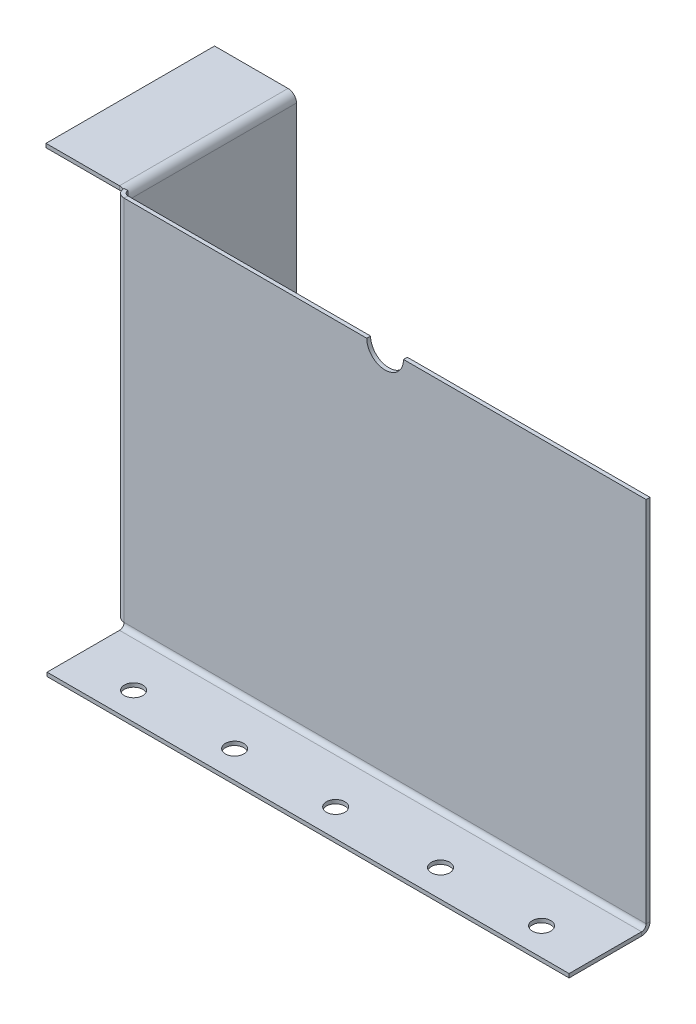
ISO-10303-21;
HEADER;
FILE_DESCRIPTION(('STEP AP214'),'2;1');
FILE_NAME('part.step','',(''),(''),'','','');
FILE_SCHEMA(('AUTOMOTIVE_DESIGN { 1 0 10303 214 1 1 1 1 }'));
ENDSEC;
DATA;
#1=APPLICATION_CONTEXT('core data for automotive mechanical design processes');
#2=APPLICATION_PROTOCOL_DEFINITION('international standard','automotive_design',2000,#1);
#3=PRODUCT_CONTEXT('',#1,'mechanical');
#4=PRODUCT('Part','Part','',(#3));
#5=PRODUCT_RELATED_PRODUCT_CATEGORY('part','',(#4));
#6=PRODUCT_DEFINITION_FORMATION('','',#4);
#7=PRODUCT_DEFINITION_CONTEXT('part definition',#1,'design');
#8=PRODUCT_DEFINITION('design','',#6,#7);
#9=PRODUCT_DEFINITION_SHAPE('','',#8);
#10=(LENGTH_UNIT() NAMED_UNIT(*) SI_UNIT(.MILLI.,.METRE.));
#11=(NAMED_UNIT(*) PLANE_ANGLE_UNIT() SI_UNIT($,.RADIAN.));
#12=(NAMED_UNIT(*) SI_UNIT($,.STERADIAN.) SOLID_ANGLE_UNIT());
#13=UNCERTAINTY_MEASURE_WITH_UNIT(LENGTH_MEASURE(1.E-05),#10,'distance_accuracy_value','');
#14=(GEOMETRIC_REPRESENTATION_CONTEXT(3) GLOBAL_UNCERTAINTY_ASSIGNED_CONTEXT((#13)) GLOBAL_UNIT_ASSIGNED_CONTEXT((#10,
#11,#12)) REPRESENTATION_CONTEXT('',''));
#15=CARTESIAN_POINT('',(0.,0.,0.));
#16=DIRECTION('',(0.,0.,1.));
#17=DIRECTION('',(1.,0.,0.));
#18=AXIS2_PLACEMENT_3D('',#15,#16,#17);
#19=CARTESIAN_POINT('',(-5.83183999999996,248.16816,-5.83183999999998));
#20=DIRECTION('',(0.,0.,-1.));
#21=DIRECTION('',(-1.,0.,0.));
#22=AXIS2_PLACEMENT_3D('',#19,#20,#21);
#23=PLANE('',#22);
#24=DIRECTION('',(0.,1.,0.));
#25=VECTOR('',#24,1.);
#26=CARTESIAN_POINT('',(-3.175,0.,-5.83183999999999));
#27=LINE('',#26,#25);
#28=CARTESIAN_POINT('',(-3.17499999999996,248.16816,-5.83183999999999));
#29=VERTEX_POINT('',#28);
#30=CARTESIAN_POINT('',(-3.17499999999998,254.,-5.83183999999999));
#31=VERTEX_POINT('',#30);
#32=EDGE_CURVE('E307',#29,#31,#27,.T.);
#33=ORIENTED_EDGE('',*,*,#32,.F.);
#34=CARTESIAN_POINT('',(-9.00683999999997,248.16816,-5.83183999999996));
#35=DIRECTION('',(0.,0.,-1.));
#36=DIRECTION('',(-1.,0.,0.));
#37=AXIS2_PLACEMENT_3D('',#34,#35,#36);
#38=CIRCLE('',#37,5.83184000000001);
#39=CARTESIAN_POINT('',(-5.83184,253.059962611063,-5.83183999999998));
#40=VERTEX_POINT('',#39);
#41=EDGE_CURVE('E267',#29,#40,#38,.F.);
#42=ORIENTED_EDGE('',*,*,#41,.T.);
#43=DIRECTION('',(0.,1.,0.));
#44=VECTOR('',#43,1.);
#45=CARTESIAN_POINT('',(-5.83184,0.,-5.83183999999998));
#46=LINE('',#45,#44);
#47=CARTESIAN_POINT('',(-5.83184,254.,-5.83183999999998));
#48=VERTEX_POINT('',#47);
#49=EDGE_CURVE('E296',#48,#40,#46,.F.);
#50=ORIENTED_EDGE('',*,*,#49,.F.);
#51=DIRECTION('',(1.,0.,0.));
#52=VECTOR('',#51,1.);
#53=CARTESIAN_POINT('',(-3.175,254.,-5.83183999999999));
#54=LINE('',#53,#52);
#55=EDGE_CURVE('E301',#31,#48,#54,.F.);
#56=ORIENTED_EDGE('',*,*,#55,.F.);
#57=EDGE_LOOP('',(#33,#42,#50,#56));
#58=FACE_BOUND('',#57,.T.);
#59=ADVANCED_FACE('F83',(#58),#23,.T.);
#60=CARTESIAN_POINT('',(-5.83183999999998,0.,0.));
#61=DIRECTION('',(1.,0.,0.));
#62=DIRECTION('',(0.,0.,-1.));
#63=AXIS2_PLACEMENT_3D('',#60,#61,#62);
#64=PLANE('',#63);
#65=CARTESIAN_POINT('',(-5.83184000000009,45.9666651247962,-32.886251514046));
#66=DIRECTION('',(-1.,0.,0.));
#67=DIRECTION('',(0.,0.,1.));
#68=AXIS2_PLACEMENT_3D('',#65,#66,#67);
#69=CIRCLE('',#68,6.34999999999994);
#70=CARTESIAN_POINT('',(-5.83184000000007,45.9666651247962,-26.5362515140461));
#71=VERTEX_POINT('',#70);
#72=EDGE_CURVE('E261',#71,#71,#69,.T.);
#73=ORIENTED_EDGE('',*,*,#72,.F.);
#74=EDGE_LOOP('',(#73));
#75=FACE_BOUND('',#74,.T.);
#76=CARTESIAN_POINT('',(-5.83184000000029,43.3241595873132,-89.0215894994396));
#77=DIRECTION('',(-1.,0.,0.));
#78=DIRECTION('',(0.,0.,1.));
#79=AXIS2_PLACEMENT_3D('',#76,#77,#78);
#80=CIRCLE('',#79,6.34999999999994);
#81=CARTESIAN_POINT('',(-5.83184000000027,43.3241595873132,-82.6715894994397));
#82=VERTEX_POINT('',#81);
#83=EDGE_CURVE('E907',#82,#82,#80,.T.);
#84=ORIENTED_EDGE('',*,*,#83,.F.);
#85=EDGE_LOOP('',(#84));
#86=FACE_BOUND('',#85,.T.);
#87=DIRECTION('',(0.,0.,-1.));
#88=VECTOR('',#87,1.);
#89=CARTESIAN_POINT('',(-5.8318400000004,248.16816,-122.35434));
#90=LINE('',#89,#88);
#91=CARTESIAN_POINT('',(-5.8318400000004,248.16816,-122.35434));
#92=VERTEX_POINT('',#91);
#93=CARTESIAN_POINT('',(-5.83184,248.16816,-5.83183999999998));
#94=VERTEX_POINT('',#93);
#95=EDGE_CURVE('E274',#92,#94,#90,.F.);
#96=ORIENTED_EDGE('',*,*,#95,.F.);
#97=DIRECTION('',(0.,-1.,0.));
#98=VECTOR('',#97,1.);
#99=CARTESIAN_POINT('',(-5.83184000000041,0.,-122.35434));
#100=LINE('',#99,#98);
#101=CARTESIAN_POINT('',(-5.83184000000041,0.,-122.35434));
#102=VERTEX_POINT('',#101);
#103=EDGE_CURVE('E289',#92,#102,#100,.T.);
#104=ORIENTED_EDGE('',*,*,#103,.T.);
#105=DIRECTION('',(0.,0.,1.));
#106=VECTOR('',#105,1.);
#107=CARTESIAN_POINT('',(-5.83183999999998,0.,0.));
#108=LINE('',#107,#106);
#109=CARTESIAN_POINT('',(-5.83184,0.,-5.83183999999998));
#110=VERTEX_POINT('',#109);
#111=EDGE_CURVE('E286',#102,#110,#108,.T.);
#112=ORIENTED_EDGE('',*,*,#111,.T.);
#113=EDGE_CURVE('E300',#94,#110,#46,.F.);
#114=ORIENTED_EDGE('',*,*,#113,.F.);
#115=EDGE_LOOP('',(#96,#104,#112,#114));
#116=FACE_BOUND('',#115,.T.);
#117=ADVANCED_FACE('F506',(#75,#86,#116),#64,.F.);
#118=CARTESIAN_POINT('',(-3.17499999999998,0.,0.));
#119=DIRECTION('',(1.,0.,0.));
#120=DIRECTION('',(0.,0.,-1.));
#121=AXIS2_PLACEMENT_3D('',#118,#119,#120);
#122=PLANE('',#121);
#123=CARTESIAN_POINT('',(-3.17500000000009,45.9666651247962,-32.886251514046));
#124=DIRECTION('',(1.,0.,0.));
#125=DIRECTION('',(0.,0.,-1.));
#126=AXIS2_PLACEMENT_3D('',#123,#124,#125);
#127=CIRCLE('',#126,6.34999999999994);
#128=CARTESIAN_POINT('',(-3.17500000000012,45.9666651247962,-39.236251514046));
#129=VERTEX_POINT('',#128);
#130=EDGE_CURVE('E903',#129,#129,#127,.F.);
#131=ORIENTED_EDGE('',*,*,#130,.T.);
#132=EDGE_LOOP('',(#131));
#133=FACE_BOUND('',#132,.T.);
#134=CARTESIAN_POINT('',(-3.17500000000032,43.3241595873132,-89.0215894994396));
#135=DIRECTION('',(1.,0.,0.));
#136=DIRECTION('',(0.,0.,-1.));
#137=AXIS2_PLACEMENT_3D('',#134,#135,#136);
#138=CIRCLE('',#137,6.34999999999994);
#139=CARTESIAN_POINT('',(-3.17500000000034,43.3241595873132,-95.3715894994396));
#140=VERTEX_POINT('',#139);
#141=EDGE_CURVE('E912',#140,#140,#138,.F.);
#142=ORIENTED_EDGE('',*,*,#141,.T.);
#143=EDGE_LOOP('',(#142));
#144=FACE_BOUND('',#143,.T.);
#145=DIRECTION('',(0.,1.,0.));
#146=VECTOR('',#145,1.);
#147=CARTESIAN_POINT('',(-3.17500000000041,0.,-122.35434));
#148=LINE('',#147,#146);
#149=CARTESIAN_POINT('',(-3.1750000000004,248.16816,-122.35434));
#150=VERTEX_POINT('',#149);
#151=CARTESIAN_POINT('',(-3.17500000000041,0.,-122.35434));
#152=VERTEX_POINT('',#151);
#153=EDGE_CURVE('E294',#150,#152,#148,.F.);
#154=ORIENTED_EDGE('',*,*,#153,.F.);
#155=DIRECTION('',(0.,0.,-1.));
#156=VECTOR('',#155,1.);
#157=CARTESIAN_POINT('',(-3.1750000000004,248.16816,-122.35434));
#158=LINE('',#157,#156);
#159=EDGE_CURVE('E262',#150,#29,#158,.F.);
#160=ORIENTED_EDGE('',*,*,#159,.T.);
#161=CARTESIAN_POINT('',(-3.175,0.,-5.83183999999999));
#162=VERTEX_POINT('',#161);
#163=EDGE_CURVE('E304',#162,#29,#27,.T.);
#164=ORIENTED_EDGE('',*,*,#163,.F.);
#165=DIRECTION('',(0.,0.,-1.));
#166=VECTOR('',#165,1.);
#167=CARTESIAN_POINT('',(-3.17499999999999,0.,-2.65684));
#168=LINE('',#167,#166);
#169=EDGE_CURVE('E291',#152,#162,#168,.F.);
#170=ORIENTED_EDGE('',*,*,#169,.F.);
#171=EDGE_LOOP('',(#154,#160,#164,#170));
#172=FACE_BOUND('',#171,.T.);
#173=ADVANCED_FACE('F512',(#133,#144,#172),#122,.T.);
#174=CARTESIAN_POINT('',(-5.83184000000041,0.,-122.35434));
#175=DIRECTION('',(0.,0.,1.));
#176=DIRECTION('',(1.,0.,0.));
#177=AXIS2_PLACEMENT_3D('',#174,#175,#176);
#178=PLANE('',#177);
#179=DIRECTION('',(1.,0.,0.));
#180=VECTOR('',#179,1.);
#181=CARTESIAN_POINT('',(-5.8318400000004,248.16816,-122.35434));
#182=LINE('',#181,#180);
#183=EDGE_CURVE('E270',#92,#150,#182,.T.);
#184=ORIENTED_EDGE('',*,*,#183,.T.);
#185=ORIENTED_EDGE('',*,*,#153,.T.);
#186=DIRECTION('',(1.,0.,0.));
#187=VECTOR('',#186,1.);
#188=CARTESIAN_POINT('',(-5.83184000000041,0.,-122.35434));
#189=LINE('',#188,#187);
#190=EDGE_CURVE('E282',#102,#152,#189,.T.);
#191=ORIENTED_EDGE('',*,*,#190,.F.);
#192=ORIENTED_EDGE('',*,*,#103,.F.);
#193=EDGE_LOOP('',(#184,#185,#191,#192));
#194=FACE_BOUND('',#193,.T.);
#195=ADVANCED_FACE('F522',(#194),#178,.F.);
#196=CARTESIAN_POINT('',(0.,-5.83184000000003,-3.89895559401467));
#197=DIRECTION('',(-1.,0.,0.));
#198=DIRECTION('',(0.,1.,0.));
#199=AXIS2_PLACEMENT_3D('',#196,#197,#198);
#200=PLANE('',#199);
#201=DIRECTION('',(0.,0.,1.));
#202=VECTOR('',#201,1.);
#203=CARTESIAN_POINT('',(0.,-3.17500000000003,-3.89895559401468));
#204=LINE('',#203,#202);
#205=CARTESIAN_POINT('',(0.,-3.175,3.175));
#206=VERTEX_POINT('',#205);
#207=CARTESIAN_POINT('',(0.,-3.17499999999983,53.2510444059853));
#208=VERTEX_POINT('',#207);
#209=EDGE_CURVE('E432',#206,#208,#204,.T.);
#210=ORIENTED_EDGE('',*,*,#209,.F.);
#211=DIRECTION('',(0.,-1.,0.));
#212=VECTOR('',#211,1.);
#213=CARTESIAN_POINT('',(0.,-5.83184000000005,3.175));
#214=LINE('',#213,#212);
#215=CARTESIAN_POINT('',(0.,-5.83184,3.17500000000002));
#216=VERTEX_POINT('',#215);
#217=EDGE_CURVE('E427',#206,#216,#214,.T.);
#218=ORIENTED_EDGE('',*,*,#217,.T.);
#219=DIRECTION('',(0.,0.,1.));
#220=VECTOR('',#219,1.);
#221=CARTESIAN_POINT('',(0.,-5.83184000000003,-3.89895559401467));
#222=LINE('',#221,#220);
#223=CARTESIAN_POINT('',(0.,-5.83183999999983,53.2510444059853));
#224=VERTEX_POINT('',#223);
#225=EDGE_CURVE('E87',#216,#224,#222,.T.);
#226=ORIENTED_EDGE('',*,*,#225,.T.);
#227=DIRECTION('',(0.,1.,0.));
#228=VECTOR('',#227,1.);
#229=CARTESIAN_POINT('',(0.,-5.83183999999983,53.2510444059853));
#230=LINE('',#229,#228);
#231=EDGE_CURVE('E422',#224,#208,#230,.T.);
#232=ORIENTED_EDGE('',*,*,#231,.T.);
#233=EDGE_LOOP('',(#210,#218,#226,#232));
#234=FACE_BOUND('',#233,.T.);
#235=ADVANCED_FACE('F436',(#234),#200,.T.);
#236=CARTESIAN_POINT('',(360.91368,-5.83184000000003,-3.89895559401467));
#237=DIRECTION('',(1.,0.,0.));
#238=DIRECTION('',(0.,-1.,0.));
#239=AXIS2_PLACEMENT_3D('',#236,#237,#238);
#240=PLANE('',#239);
#241=DIRECTION('',(0.,0.,-1.));
#242=VECTOR('',#241,1.);
#243=CARTESIAN_POINT('',(360.91368,-5.83184000000003,-3.89895559401467));
#244=LINE('',#243,#242);
#245=CARTESIAN_POINT('',(360.91368,-5.83183999999983,53.2510444059853));
#246=VERTEX_POINT('',#245);
#247=CARTESIAN_POINT('',(360.91368,-5.83184,3.17500000000002));
#248=VERTEX_POINT('',#247);
#249=EDGE_CURVE('E416',#246,#248,#244,.T.);
#250=ORIENTED_EDGE('',*,*,#249,.T.);
#251=DIRECTION('',(0.,1.,0.));
#252=VECTOR('',#251,1.);
#253=CARTESIAN_POINT('',(360.91368,-5.83184000000005,3.175));
#254=LINE('',#253,#252);
#255=CARTESIAN_POINT('',(360.91368,-3.175,3.175));
#256=VERTEX_POINT('',#255);
#257=EDGE_CURVE('E13',#248,#256,#254,.T.);
#258=ORIENTED_EDGE('',*,*,#257,.T.);
#259=DIRECTION('',(0.,0.,-1.));
#260=VECTOR('',#259,1.);
#261=CARTESIAN_POINT('',(360.91368,-3.17500000000003,-3.89895559401468));
#262=LINE('',#261,#260);
#263=CARTESIAN_POINT('',(360.91368,-3.17499999999983,53.2510444059853));
#264=VERTEX_POINT('',#263);
#265=EDGE_CURVE('E108',#264,#256,#262,.T.);
#266=ORIENTED_EDGE('',*,*,#265,.F.);
#267=DIRECTION('',(0.,1.,0.));
#268=VECTOR('',#267,1.);
#269=CARTESIAN_POINT('',(360.91368,-5.83183999999983,53.2510444059853));
#270=LINE('',#269,#268);
#271=EDGE_CURVE('E418',#246,#264,#270,.T.);
#272=ORIENTED_EDGE('',*,*,#271,.F.);
#273=EDGE_LOOP('',(#250,#258,#266,#272));
#274=FACE_BOUND('',#273,.T.);
#275=ADVANCED_FACE('F85',(#274),#240,.T.);
#276=CARTESIAN_POINT('',(180.45684,-3.17500000000092,-257.898955594015));
#277=DIRECTION('',(0.,1.,0.));
#278=DIRECTION('',(1.,0.,0.));
#279=AXIS2_PLACEMENT_3D('',#276,#277,#278);
#280=PLANE('',#279);
#281=CARTESIAN_POINT('',(322.81368,-3.1749999999999,34.2010444059853));
#282=DIRECTION('',(0.,1.,0.));
#283=DIRECTION('',(0.,0.,1.));
#284=AXIS2_PLACEMENT_3D('',#281,#282,#283);
#285=CIRCLE('',#284,6.35);
#286=CARTESIAN_POINT('',(322.81368,-3.17499999999987,40.5510444059853));
#287=VERTEX_POINT('',#286);
#288=EDGE_CURVE('E322',#287,#287,#285,.T.);
#289=ORIENTED_EDGE('',*,*,#288,.F.);
#290=EDGE_LOOP('',(#289));
#291=FACE_BOUND('',#290,.T.);
#292=CARTESIAN_POINT('',(180.45684,-3.1749999999999,34.2010444059853));
#293=DIRECTION('',(0.,1.,0.));
#294=DIRECTION('',(0.,0.,1.));
#295=AXIS2_PLACEMENT_3D('',#292,#293,#294);
#296=CIRCLE('',#295,6.35);
#297=CARTESIAN_POINT('',(180.45684,-3.17499999999987,40.5510444059853));
#298=VERTEX_POINT('',#297);
#299=EDGE_CURVE('E313',#298,#298,#296,.T.);
#300=ORIENTED_EDGE('',*,*,#299,.F.);
#301=EDGE_LOOP('',(#300));
#302=FACE_BOUND('',#301,.T.);
#303=CARTESIAN_POINT('',(110.60684,-3.1749999999999,34.2010444059853));
#304=DIRECTION('',(0.,1.,0.));
#305=DIRECTION('',(0.,0.,1.));
#306=AXIS2_PLACEMENT_3D('',#303,#304,#305);
#307=CIRCLE('',#306,6.35);
#308=CARTESIAN_POINT('',(110.60684,-3.17499999999987,40.5510444059853));
#309=VERTEX_POINT('',#308);
#310=EDGE_CURVE('E330',#309,#309,#307,.T.);
#311=ORIENTED_EDGE('',*,*,#310,.F.);
#312=EDGE_LOOP('',(#311));
#313=FACE_BOUND('',#312,.T.);
#314=CARTESIAN_POINT('',(40.75684,-3.1749999999999,34.2010444059853));
#315=DIRECTION('',(0.,1.,0.));
#316=DIRECTION('',(0.,0.,1.));
#317=AXIS2_PLACEMENT_3D('',#314,#315,#316);
#318=CIRCLE('',#317,6.35);
#319=CARTESIAN_POINT('',(40.75684,-3.17499999999987,40.5510444059853));
#320=VERTEX_POINT('',#319);
#321=EDGE_CURVE('E337',#320,#320,#318,.T.);
#322=ORIENTED_EDGE('',*,*,#321,.F.);
#323=EDGE_LOOP('',(#322));
#324=FACE_BOUND('',#323,.T.);
#325=CARTESIAN_POINT('',(252.96368,-3.1749999999999,34.2010444059853));
#326=DIRECTION('',(0.,1.,0.));
#327=DIRECTION('',(0.,0.,1.));
#328=AXIS2_PLACEMENT_3D('',#325,#326,#327);
#329=CIRCLE('',#328,6.34999999999994);
#330=CARTESIAN_POINT('',(252.96368,-3.17499999999987,40.5510444059853));
#331=VERTEX_POINT('',#330);
#332=EDGE_CURVE('E342',#331,#331,#329,.T.);
#333=ORIENTED_EDGE('',*,*,#332,.F.);
#334=EDGE_LOOP('',(#333));
#335=FACE_BOUND('',#334,.T.);
#336=ORIENTED_EDGE('',*,*,#265,.T.);
#337=DIRECTION('',(-1.,0.,0.));
#338=VECTOR('',#337,1.);
#339=CARTESIAN_POINT('',(180.45684,-3.175,3.17500000000001));
#340=LINE('',#339,#338);
#341=EDGE_CURVE('E92',#256,#206,#340,.T.);
#342=ORIENTED_EDGE('',*,*,#341,.T.);
#343=ORIENTED_EDGE('',*,*,#209,.T.);
#344=DIRECTION('',(1.,0.,0.));
#345=VECTOR('',#344,1.);
#346=CARTESIAN_POINT('',(0.,-3.17499999999983,53.2510444059853));
#347=LINE('',#346,#345);
#348=EDGE_CURVE('E367',#208,#264,#347,.T.);
#349=ORIENTED_EDGE('',*,*,#348,.T.);
#350=EDGE_LOOP('',(#336,#342,#343,#349));
#351=FACE_BOUND('',#350,.T.);
#352=ADVANCED_FACE('F494',(#291,#302,#313,#324,#335,#351),#280,.T.);
#353=CARTESIAN_POINT('',(0.,-5.83183999999983,53.2510444059853));
#354=DIRECTION('',(0.,0.,1.));
#355=DIRECTION('',(0.,-1.,0.));
#356=AXIS2_PLACEMENT_3D('',#353,#354,#355);
#357=PLANE('',#356);
#358=ORIENTED_EDGE('',*,*,#348,.F.);
#359=ORIENTED_EDGE('',*,*,#231,.F.);
#360=DIRECTION('',(1.,0.,0.));
#361=VECTOR('',#360,1.);
#362=CARTESIAN_POINT('',(0.,-5.83183999999983,53.2510444059853));
#363=LINE('',#362,#361);
#364=EDGE_CURVE('E413',#224,#246,#363,.T.);
#365=ORIENTED_EDGE('',*,*,#364,.T.);
#366=ORIENTED_EDGE('',*,*,#271,.T.);
#367=EDGE_LOOP('',(#358,#359,#365,#366));
#368=FACE_BOUND('',#367,.T.);
#369=ADVANCED_FACE('F442',(#368),#357,.T.);
#370=CARTESIAN_POINT('',(180.45684,-5.83184000000091,-257.898955594015));
#371=DIRECTION('',(0.,1.,0.));
#372=DIRECTION('',(1.,0.,0.));
#373=AXIS2_PLACEMENT_3D('',#370,#371,#372);
#374=PLANE('',#373);
#375=CARTESIAN_POINT('',(322.81368,-5.83183999999989,34.2010444059853));
#376=DIRECTION('',(0.,1.,0.));
#377=DIRECTION('',(0.,0.,1.));
#378=AXIS2_PLACEMENT_3D('',#375,#376,#377);
#379=CIRCLE('',#378,6.35);
#380=CARTESIAN_POINT('',(322.81368,-5.83183999999987,40.5510444059853));
#381=VERTEX_POINT('',#380);
#382=EDGE_CURVE('E325',#381,#381,#379,.F.);
#383=ORIENTED_EDGE('',*,*,#382,.F.);
#384=EDGE_LOOP('',(#383));
#385=FACE_BOUND('',#384,.T.);
#386=CARTESIAN_POINT('',(180.45684,-5.83183999999989,34.2010444059853));
#387=DIRECTION('',(0.,1.,0.));
#388=DIRECTION('',(0.,0.,1.));
#389=AXIS2_PLACEMENT_3D('',#386,#387,#388);
#390=CIRCLE('',#389,6.35);
#391=CARTESIAN_POINT('',(180.45684,-5.83183999999987,40.5510444059853));
#392=VERTEX_POINT('',#391);
#393=EDGE_CURVE('E334',#392,#392,#390,.F.);
#394=ORIENTED_EDGE('',*,*,#393,.F.);
#395=EDGE_LOOP('',(#394));
#396=FACE_BOUND('',#395,.T.);
#397=CARTESIAN_POINT('',(110.60684,-5.83183999999989,34.2010444059853));
#398=DIRECTION('',(0.,1.,0.));
#399=DIRECTION('',(0.,0.,1.));
#400=AXIS2_PLACEMENT_3D('',#397,#398,#399);
#401=CIRCLE('',#400,6.35);
#402=CARTESIAN_POINT('',(110.60684,-5.83183999999987,40.5510444059853));
#403=VERTEX_POINT('',#402);
#404=EDGE_CURVE('E333',#403,#403,#401,.F.);
#405=ORIENTED_EDGE('',*,*,#404,.F.);
#406=EDGE_LOOP('',(#405));
#407=FACE_BOUND('',#406,.T.);
#408=CARTESIAN_POINT('',(40.75684,-5.83183999999989,34.2010444059853));
#409=DIRECTION('',(0.,1.,0.));
#410=DIRECTION('',(0.,0.,1.));
#411=AXIS2_PLACEMENT_3D('',#408,#409,#410);
#412=CIRCLE('',#411,6.35);
#413=CARTESIAN_POINT('',(40.75684,-5.83183999999987,40.5510444059853));
#414=VERTEX_POINT('',#413);
#415=EDGE_CURVE('E345',#414,#414,#412,.F.);
#416=ORIENTED_EDGE('',*,*,#415,.F.);
#417=EDGE_LOOP('',(#416));
#418=FACE_BOUND('',#417,.T.);
#419=CARTESIAN_POINT('',(252.96368,-5.83183999999989,34.2010444059853));
#420=DIRECTION('',(0.,1.,0.));
#421=DIRECTION('',(0.,0.,1.));
#422=AXIS2_PLACEMENT_3D('',#419,#420,#421);
#423=CIRCLE('',#422,6.34999999999994);
#424=CARTESIAN_POINT('',(252.96368,-5.83183999999987,40.5510444059853));
#425=VERTEX_POINT('',#424);
#426=EDGE_CURVE('E326',#425,#425,#423,.F.);
#427=ORIENTED_EDGE('',*,*,#426,.F.);
#428=EDGE_LOOP('',(#427));
#429=FACE_BOUND('',#428,.T.);
#430=DIRECTION('',(-1.,0.,0.));
#431=VECTOR('',#430,1.);
#432=CARTESIAN_POINT('',(180.45684,-5.83184,3.17500000000002));
#433=LINE('',#432,#431);
#434=EDGE_CURVE('E421',#248,#216,#433,.T.);
#435=ORIENTED_EDGE('',*,*,#434,.F.);
#436=ORIENTED_EDGE('',*,*,#249,.F.);
#437=ORIENTED_EDGE('',*,*,#364,.F.);
#438=ORIENTED_EDGE('',*,*,#225,.F.);
#439=EDGE_LOOP('',(#435,#436,#437,#438));
#440=FACE_BOUND('',#439,.T.);
#441=ADVANCED_FACE('F444',(#385,#396,#407,#418,#429,#440),#374,.F.);
#442=CARTESIAN_POINT('',(193.15684,254.,-2.65684));
#443=DIRECTION('',(0.,1.,0.));
#444=DIRECTION('',(-1.,0.,0.));
#445=AXIS2_PLACEMENT_3D('',#442,#443,#444);
#446=PLANE('',#445);
#447=DIRECTION('',(-1.,0.,0.));
#448=VECTOR('',#447,1.);
#449=CARTESIAN_POINT('',(193.15684,254.,0.));
#450=LINE('',#449,#448);
#451=CARTESIAN_POINT('',(360.91368,254.,0.));
#452=VERTEX_POINT('',#451);
#453=CARTESIAN_POINT('',(193.15684,254.,0.));
#454=VERTEX_POINT('',#453);
#455=EDGE_CURVE('E379',#452,#454,#450,.T.);
#456=ORIENTED_EDGE('',*,*,#455,.F.);
#457=DIRECTION('',(0.,0.,1.));
#458=VECTOR('',#457,1.);
#459=CARTESIAN_POINT('',(360.91368,254.,-2.65684));
#460=LINE('',#459,#458);
#461=CARTESIAN_POINT('',(360.91368,254.,-2.65684));
#462=VERTEX_POINT('',#461);
#463=EDGE_CURVE('E364',#462,#452,#460,.T.);
#464=ORIENTED_EDGE('',*,*,#463,.F.);
#465=DIRECTION('',(-1.,0.,0.));
#466=VECTOR('',#465,1.);
#467=CARTESIAN_POINT('',(193.15684,254.,-2.65684));
#468=LINE('',#467,#466);
#469=CARTESIAN_POINT('',(193.15684,254.,-2.65684));
#470=VERTEX_POINT('',#469);
#471=EDGE_CURVE('E402',#462,#470,#468,.T.);
#472=ORIENTED_EDGE('',*,*,#471,.T.);
#473=DIRECTION('',(0.,0.,1.));
#474=VECTOR('',#473,1.);
#475=CARTESIAN_POINT('',(193.15684,254.,-2.65684));
#476=LINE('',#475,#474);
#477=EDGE_CURVE('E400',#470,#454,#476,.T.);
#478=ORIENTED_EDGE('',*,*,#477,.T.);
#479=EDGE_LOOP('',(#456,#464,#472,#478));
#480=FACE_BOUND('',#479,.T.);
#481=ADVANCED_FACE('F488',(#480),#446,.T.);
#482=CARTESIAN_POINT('',(180.45684,254.,-2.65684));
#483=DIRECTION('',(0.,0.,1.));
#484=DIRECTION('',(1.,0.,0.));
#485=AXIS2_PLACEMENT_3D('',#482,#483,#484);
#486=CYLINDRICAL_SURFACE('',#485,12.7);
#487=CARTESIAN_POINT('',(180.45684,254.,0.));
#488=DIRECTION('',(0.,0.,-1.));
#489=DIRECTION('',(1.,0.,0.));
#490=AXIS2_PLACEMENT_3D('',#487,#488,#489);
#491=CIRCLE('',#490,12.7);
#492=CARTESIAN_POINT('',(167.75684,254.,0.));
#493=VERTEX_POINT('',#492);
#494=EDGE_CURVE('E376',#454,#493,#491,.T.);
#495=ORIENTED_EDGE('',*,*,#494,.F.);
#496=ORIENTED_EDGE('',*,*,#477,.F.);
#497=CARTESIAN_POINT('',(180.45684,254.,-2.65684));
#498=DIRECTION('',(0.,0.,-1.));
#499=DIRECTION('',(1.,0.,0.));
#500=AXIS2_PLACEMENT_3D('',#497,#498,#499);
#501=CIRCLE('',#500,12.7);
#502=CARTESIAN_POINT('',(167.75684,254.,-2.65684));
#503=VERTEX_POINT('',#502);
#504=EDGE_CURVE('E397',#470,#503,#501,.T.);
#505=ORIENTED_EDGE('',*,*,#504,.T.);
#506=DIRECTION('',(0.,0.,1.));
#507=VECTOR('',#506,1.);
#508=CARTESIAN_POINT('',(167.75684,254.,-2.65684));
#509=LINE('',#508,#507);
#510=EDGE_CURVE('E395',#503,#493,#509,.T.);
#511=ORIENTED_EDGE('',*,*,#510,.T.);
#512=EDGE_LOOP('',(#495,#496,#505,#511));
#513=FACE_BOUND('',#512,.T.);
#514=ADVANCED_FACE('F485',(#513),#486,.F.);
#515=CARTESIAN_POINT('',(0.,254.,-2.65684));
#516=DIRECTION('',(0.,1.,0.));
#517=DIRECTION('',(-1.,0.,0.));
#518=AXIS2_PLACEMENT_3D('',#515,#516,#517);
#519=PLANE('',#518);
#520=DIRECTION('',(-1.,0.,0.));
#521=VECTOR('',#520,1.);
#522=CARTESIAN_POINT('',(0.,254.,0.));
#523=LINE('',#522,#521);
#524=CARTESIAN_POINT('',(0.,254.,0.));
#525=VERTEX_POINT('',#524);
#526=EDGE_CURVE('E373',#493,#525,#523,.T.);
#527=ORIENTED_EDGE('',*,*,#526,.F.);
#528=ORIENTED_EDGE('',*,*,#510,.F.);
#529=DIRECTION('',(-1.,0.,0.));
#530=VECTOR('',#529,1.);
#531=CARTESIAN_POINT('',(0.,254.,-2.65684));
#532=LINE('',#531,#530);
#533=CARTESIAN_POINT('',(0.,254.,-2.65684000000001));
#534=VERTEX_POINT('',#533);
#535=EDGE_CURVE('E392',#503,#534,#532,.T.);
#536=ORIENTED_EDGE('',*,*,#535,.T.);
#537=DIRECTION('',(0.,0.,1.));
#538=VECTOR('',#537,1.);
#539=CARTESIAN_POINT('',(0.,254.,-2.65684));
#540=LINE('',#539,#538);
#541=EDGE_CURVE('E389',#534,#525,#540,.T.);
#542=ORIENTED_EDGE('',*,*,#541,.T.);
#543=EDGE_LOOP('',(#527,#528,#536,#542));
#544=FACE_BOUND('',#543,.T.);
#545=ADVANCED_FACE('F481',(#544),#519,.T.);
#546=CARTESIAN_POINT('',(180.45684,254.,-2.65684));
#547=DIRECTION('',(0.,0.,1.));
#548=DIRECTION('',(1.,0.,0.));
#549=AXIS2_PLACEMENT_3D('',#546,#547,#548);
#550=PLANE('',#549);
#551=DIRECTION('',(0.,1.,0.));
#552=VECTOR('',#551,1.);
#553=CARTESIAN_POINT('',(360.91368,0.,-2.65684));
#554=LINE('',#553,#552);
#555=CARTESIAN_POINT('',(360.91368,0.,-2.65684));
#556=VERTEX_POINT('',#555);
#557=EDGE_CURVE('E368',#556,#462,#554,.T.);
#558=ORIENTED_EDGE('',*,*,#557,.F.);
#559=DIRECTION('',(-1.,0.,0.));
#560=VECTOR('',#559,1.);
#561=CARTESIAN_POINT('',(180.45684,0.,-2.65684));
#562=LINE('',#561,#560);
#563=CARTESIAN_POINT('',(0.,0.,-2.65684000000001));
#564=VERTEX_POINT('',#563);
#565=EDGE_CURVE('E386',#556,#564,#562,.T.);
#566=ORIENTED_EDGE('',*,*,#565,.T.);
#567=DIRECTION('',(0.,-1.,0.));
#568=VECTOR('',#567,1.);
#569=CARTESIAN_POINT('',(0.,0.,-2.65684));
#570=LINE('',#569,#568);
#571=EDGE_CURVE('E384',#534,#564,#570,.T.);
#572=ORIENTED_EDGE('',*,*,#571,.F.);
#573=ORIENTED_EDGE('',*,*,#535,.F.);
#574=ORIENTED_EDGE('',*,*,#504,.F.);
#575=ORIENTED_EDGE('',*,*,#471,.F.);
#576=EDGE_LOOP('',(#558,#566,#572,#573,#574,#575));
#577=FACE_BOUND('',#576,.T.);
#578=ADVANCED_FACE('F458',(#577),#550,.F.);
#579=CARTESIAN_POINT('',(180.45684,254.,0.));
#580=DIRECTION('',(0.,0.,1.));
#581=DIRECTION('',(1.,0.,0.));
#582=AXIS2_PLACEMENT_3D('',#579,#580,#581);
#583=PLANE('',#582);
#584=DIRECTION('',(-1.,0.,0.));
#585=VECTOR('',#584,1.);
#586=CARTESIAN_POINT('',(180.45684,0.,0.));
#587=LINE('',#586,#585);
#588=CARTESIAN_POINT('',(360.91368,0.,0.));
#589=VERTEX_POINT('',#588);
#590=CARTESIAN_POINT('',(0.,0.,0.));
#591=VERTEX_POINT('',#590);
#592=EDGE_CURVE('E408',#589,#591,#587,.T.);
#593=ORIENTED_EDGE('',*,*,#592,.F.);
#594=DIRECTION('',(0.,1.,0.));
#595=VECTOR('',#594,1.);
#596=CARTESIAN_POINT('',(360.91368,0.,0.));
#597=LINE('',#596,#595);
#598=EDGE_CURVE('E382',#589,#452,#597,.T.);
#599=ORIENTED_EDGE('',*,*,#598,.T.);
#600=ORIENTED_EDGE('',*,*,#455,.T.);
#601=ORIENTED_EDGE('',*,*,#494,.T.);
#602=ORIENTED_EDGE('',*,*,#526,.T.);
#603=DIRECTION('',(0.,-1.,0.));
#604=VECTOR('',#603,1.);
#605=CARTESIAN_POINT('',(0.,0.,0.));
#606=LINE('',#605,#604);
#607=EDGE_CURVE('E370',#525,#591,#606,.T.);
#608=ORIENTED_EDGE('',*,*,#607,.T.);
#609=EDGE_LOOP('',(#593,#599,#600,#601,#602,#608));
#610=FACE_BOUND('',#609,.T.);
#611=ADVANCED_FACE('F471',(#610),#583,.T.);
#612=CARTESIAN_POINT('',(360.91368,0.,-2.65684));
#613=DIRECTION('',(1.,0.,0.));
#614=DIRECTION('',(0.,0.,-1.));
#615=AXIS2_PLACEMENT_3D('',#612,#613,#614);
#616=PLANE('',#615);
#617=DIRECTION('',(0.,0.,1.));
#618=VECTOR('',#617,1.);
#619=CARTESIAN_POINT('',(360.91368,0.,-2.65684));
#620=LINE('',#619,#618);
#621=EDGE_CURVE('E359',#556,#589,#620,.T.);
#622=ORIENTED_EDGE('',*,*,#621,.F.);
#623=ORIENTED_EDGE('',*,*,#557,.T.);
#624=ORIENTED_EDGE('',*,*,#463,.T.);
#625=ORIENTED_EDGE('',*,*,#598,.F.);
#626=EDGE_LOOP('',(#622,#623,#624,#625));
#627=FACE_BOUND('',#626,.T.);
#628=ADVANCED_FACE('F491',(#627),#616,.T.);
#629=CARTESIAN_POINT('',(360.91368,0.,3.175));
#630=DIRECTION('',(1.,0.,0.));
#631=DIRECTION('',(0.,0.,-1.));
#632=AXIS2_PLACEMENT_3D('',#629,#630,#631);
#633=PLANE('',#632);
#634=ORIENTED_EDGE('',*,*,#621,.T.);
#635=CARTESIAN_POINT('',(360.91368,0.,3.175));
#636=DIRECTION('',(-1.,0.,0.));
#637=DIRECTION('',(0.,0.,1.));
#638=AXIS2_PLACEMENT_3D('',#635,#636,#637);
#639=CIRCLE('',#638,3.175);
#640=EDGE_CURVE('E329',#589,#256,#639,.T.);
#641=ORIENTED_EDGE('',*,*,#640,.T.);
#642=ORIENTED_EDGE('',*,*,#257,.F.);
#643=CARTESIAN_POINT('',(360.91368,0.,3.175));
#644=DIRECTION('',(-1.,0.,0.));
#645=DIRECTION('',(0.,0.,-1.));
#646=AXIS2_PLACEMENT_3D('',#643,#644,#645);
#647=CIRCLE('',#646,5.83184);
#648=EDGE_CURVE('E352',#556,#248,#647,.T.);
#649=ORIENTED_EDGE('',*,*,#648,.F.);
#650=EDGE_LOOP('',(#634,#641,#642,#649));
#651=FACE_BOUND('',#650,.T.);
#652=ADVANCED_FACE('F450',(#651),#633,.T.);
#653=CARTESIAN_POINT('',(0.,0.,3.175));
#654=DIRECTION('',(-1.,0.,0.));
#655=DIRECTION('',(0.,0.,1.));
#656=AXIS2_PLACEMENT_3D('',#653,#654,#655);
#657=PLANE('',#656);
#658=ORIENTED_EDGE('',*,*,#217,.F.);
#659=CARTESIAN_POINT('',(0.,0.,3.175));
#660=DIRECTION('',(-1.,0.,0.));
#661=DIRECTION('',(0.,0.,1.));
#662=AXIS2_PLACEMENT_3D('',#659,#660,#661);
#663=CIRCLE('',#662,3.175);
#664=EDGE_CURVE('E356',#206,#591,#663,.F.);
#665=ORIENTED_EDGE('',*,*,#664,.T.);
#666=DIRECTION('',(0.,0.,-1.));
#667=VECTOR('',#666,1.);
#668=CARTESIAN_POINT('',(0.,0.,-2.65684));
#669=LINE('',#668,#667);
#670=EDGE_CURVE('E405',#591,#564,#669,.T.);
#671=ORIENTED_EDGE('',*,*,#670,.T.);
#672=CARTESIAN_POINT('',(0.,0.,3.175));
#673=DIRECTION('',(1.,0.,0.));
#674=DIRECTION('',(0.,0.,1.));
#675=AXIS2_PLACEMENT_3D('',#672,#673,#674);
#676=CIRCLE('',#675,5.83184);
#677=EDGE_CURVE('E355',#216,#564,#676,.T.);
#678=ORIENTED_EDGE('',*,*,#677,.F.);
#679=EDGE_LOOP('',(#658,#665,#671,#678));
#680=FACE_BOUND('',#679,.T.);
#681=ADVANCED_FACE('F464',(#680),#657,.T.);
#682=CARTESIAN_POINT('',(541.449615630862,0.,3.175));
#683=DIRECTION('',(-1.,0.,0.));
#684=DIRECTION('',(0.,0.,1.));
#685=AXIS2_PLACEMENT_3D('',#682,#683,#684);
#686=CYLINDRICAL_SURFACE('',#685,5.83184);
#687=ORIENTED_EDGE('',*,*,#677,.T.);
#688=ORIENTED_EDGE('',*,*,#565,.F.);
#689=ORIENTED_EDGE('',*,*,#648,.T.);
#690=ORIENTED_EDGE('',*,*,#434,.T.);
#691=EDGE_LOOP('',(#687,#688,#689,#690));
#692=FACE_BOUND('',#691,.T.);
#693=ADVANCED_FACE('F454',(#692),#686,.T.);
#694=CARTESIAN_POINT('',(541.449615630862,0.,3.175));
#695=DIRECTION('',(-1.,0.,0.));
#696=DIRECTION('',(0.,0.,1.));
#697=AXIS2_PLACEMENT_3D('',#694,#695,#696);
#698=CYLINDRICAL_SURFACE('',#697,3.175);
#699=ORIENTED_EDGE('',*,*,#664,.F.);
#700=ORIENTED_EDGE('',*,*,#341,.F.);
#701=ORIENTED_EDGE('',*,*,#640,.F.);
#702=ORIENTED_EDGE('',*,*,#592,.T.);
#703=EDGE_LOOP('',(#699,#700,#701,#702));
#704=FACE_BOUND('',#703,.T.);
#705=ADVANCED_FACE('F493',(#704),#698,.F.);
#706=CARTESIAN_POINT('',(252.96368,-5.83284000000007,34.2010444059853));
#707=DIRECTION('',(0.,1.,0.));
#708=DIRECTION('',(0.,0.,1.));
#709=AXIS2_PLACEMENT_3D('',#706,#707,#708);
#710=CYLINDRICAL_SURFACE('',#709,6.34999999999994);
#711=ORIENTED_EDGE('',*,*,#332,.T.);
#712=EDGE_LOOP('',(#711));
#713=FACE_BOUND('',#712,.T.);
#714=ORIENTED_EDGE('',*,*,#426,.T.);
#715=EDGE_LOOP('',(#714));
#716=FACE_BOUND('',#715,.T.);
#717=ADVANCED_FACE('F555',(#713,#716),#710,.F.);
#718=CARTESIAN_POINT('',(40.75684,-5.83284000000007,34.2010444059853));
#719=DIRECTION('',(0.,1.,0.));
#720=DIRECTION('',(0.,0.,1.));
#721=AXIS2_PLACEMENT_3D('',#718,#719,#720);
#722=CYLINDRICAL_SURFACE('',#721,6.35);
#723=ORIENTED_EDGE('',*,*,#321,.T.);
#724=EDGE_LOOP('',(#723));
#725=FACE_BOUND('',#724,.T.);
#726=ORIENTED_EDGE('',*,*,#415,.T.);
#727=EDGE_LOOP('',(#726));
#728=FACE_BOUND('',#727,.T.);
#729=ADVANCED_FACE('F550',(#725,#728),#722,.F.);
#730=CARTESIAN_POINT('',(110.60684,-5.83284000000007,34.2010444059853));
#731=DIRECTION('',(0.,1.,0.));
#732=DIRECTION('',(0.,0.,1.));
#733=AXIS2_PLACEMENT_3D('',#730,#731,#732);
#734=CYLINDRICAL_SURFACE('',#733,6.35);
#735=ORIENTED_EDGE('',*,*,#310,.T.);
#736=EDGE_LOOP('',(#735));
#737=FACE_BOUND('',#736,.T.);
#738=ORIENTED_EDGE('',*,*,#404,.T.);
#739=EDGE_LOOP('',(#738));
#740=FACE_BOUND('',#739,.T.);
#741=ADVANCED_FACE('F547',(#737,#740),#734,.F.);
#742=CARTESIAN_POINT('',(180.45684,-5.83284000000007,34.2010444059853));
#743=DIRECTION('',(0.,1.,0.));
#744=DIRECTION('',(0.,0.,1.));
#745=AXIS2_PLACEMENT_3D('',#742,#743,#744);
#746=CYLINDRICAL_SURFACE('',#745,6.35);
#747=ORIENTED_EDGE('',*,*,#299,.T.);
#748=EDGE_LOOP('',(#747));
#749=FACE_BOUND('',#748,.T.);
#750=ORIENTED_EDGE('',*,*,#393,.T.);
#751=EDGE_LOOP('',(#750));
#752=FACE_BOUND('',#751,.T.);
#753=ADVANCED_FACE('F545',(#749,#752),#746,.F.);
#754=CARTESIAN_POINT('',(322.81368,-5.83284000000007,34.2010444059853));
#755=DIRECTION('',(0.,1.,0.));
#756=DIRECTION('',(0.,0.,1.));
#757=AXIS2_PLACEMENT_3D('',#754,#755,#756);
#758=CYLINDRICAL_SURFACE('',#757,6.35);
#759=ORIENTED_EDGE('',*,*,#288,.T.);
#760=EDGE_LOOP('',(#759));
#761=FACE_BOUND('',#760,.T.);
#762=ORIENTED_EDGE('',*,*,#382,.T.);
#763=EDGE_LOOP('',(#762));
#764=FACE_BOUND('',#763,.T.);
#765=ADVANCED_FACE('F540',(#761,#764),#758,.F.);
#766=CARTESIAN_POINT('',(0.,0.,-5.83184));
#767=DIRECTION('',(0.,-1.,0.));
#768=DIRECTION('',(1.,0.,0.));
#769=AXIS2_PLACEMENT_3D('',#766,#767,#768);
#770=PLANE('',#769);
#771=DIRECTION('',(1.,0.,0.));
#772=VECTOR('',#771,1.);
#773=CARTESIAN_POINT('',(-5.83184,0.,-5.83183999999998));
#774=LINE('',#773,#772);
#775=EDGE_CURVE('E281',#162,#110,#774,.F.);
#776=ORIENTED_EDGE('',*,*,#775,.F.);
#777=CARTESIAN_POINT('',(0.,0.,-5.83184));
#778=DIRECTION('',(0.,1.,0.));
#779=DIRECTION('',(-1.,0.,0.));
#780=AXIS2_PLACEMENT_3D('',#777,#778,#779);
#781=CIRCLE('',#780,3.17499999999999);
#782=EDGE_CURVE('E317',#564,#162,#781,.F.);
#783=ORIENTED_EDGE('',*,*,#782,.F.);
#784=ORIENTED_EDGE('',*,*,#670,.F.);
#785=CARTESIAN_POINT('',(0.,0.,-5.83184));
#786=DIRECTION('',(0.,1.,0.));
#787=DIRECTION('',(-1.,0.,0.));
#788=AXIS2_PLACEMENT_3D('',#785,#786,#787);
#789=CIRCLE('',#788,5.83183999999999);
#790=EDGE_CURVE('E310',#591,#110,#789,.F.);
#791=ORIENTED_EDGE('',*,*,#790,.T.);
#792=EDGE_LOOP('',(#776,#783,#784,#791));
#793=FACE_BOUND('',#792,.T.);
#794=ADVANCED_FACE('F468',(#793),#770,.T.);
#795=CARTESIAN_POINT('',(0.,254.,-5.83184));
#796=DIRECTION('',(0.,-1.,0.));
#797=DIRECTION('',(1.,0.,0.));
#798=AXIS2_PLACEMENT_3D('',#795,#796,#797);
#799=PLANE('',#798);
#800=CARTESIAN_POINT('',(0.,254.,-5.83184));
#801=DIRECTION('',(0.,1.,0.));
#802=DIRECTION('',(-1.,0.,0.));
#803=AXIS2_PLACEMENT_3D('',#800,#801,#802);
#804=CIRCLE('',#803,3.17499999999999);
#805=EDGE_CURVE('E285',#31,#534,#804,.T.);
#806=ORIENTED_EDGE('',*,*,#805,.F.);
#807=ORIENTED_EDGE('',*,*,#55,.T.);
#808=CARTESIAN_POINT('',(0.,254.,-5.83184));
#809=DIRECTION('',(0.,1.,0.));
#810=DIRECTION('',(-1.,0.,0.));
#811=AXIS2_PLACEMENT_3D('',#808,#809,#810);
#812=CIRCLE('',#811,5.83183999999999);
#813=EDGE_CURVE('E314',#48,#525,#812,.T.);
#814=ORIENTED_EDGE('',*,*,#813,.T.);
#815=ORIENTED_EDGE('',*,*,#541,.F.);
#816=EDGE_LOOP('',(#806,#807,#814,#815));
#817=FACE_BOUND('',#816,.T.);
#818=ADVANCED_FACE('F477',(#817),#799,.F.);
#819=CARTESIAN_POINT('',(0.,254.,-5.83184));
#820=DIRECTION('',(0.,1.,0.));
#821=DIRECTION('',(-1.,0.,0.));
#822=AXIS2_PLACEMENT_3D('',#819,#820,#821);
#823=CYLINDRICAL_SURFACE('',#822,5.83183999999999);
#824=ORIENTED_EDGE('',*,*,#607,.F.);
#825=ORIENTED_EDGE('',*,*,#813,.F.);
#826=ORIENTED_EDGE('',*,*,#49,.T.);
#827=EDGE_CURVE('E299',#40,#94,#46,.F.);
#828=ORIENTED_EDGE('',*,*,#827,.T.);
#829=ORIENTED_EDGE('',*,*,#113,.T.);
#830=ORIENTED_EDGE('',*,*,#790,.F.);
#831=EDGE_LOOP('',(#824,#825,#826,#828,#829,#830));
#832=FACE_BOUND('',#831,.T.);
#833=ADVANCED_FACE('F474',(#832),#823,.T.);
#834=CARTESIAN_POINT('',(0.,254.,-5.83184));
#835=DIRECTION('',(0.,1.,0.));
#836=DIRECTION('',(-1.,0.,0.));
#837=AXIS2_PLACEMENT_3D('',#834,#835,#836);
#838=CYLINDRICAL_SURFACE('',#837,3.17499999999999);
#839=ORIENTED_EDGE('',*,*,#571,.T.);
#840=ORIENTED_EDGE('',*,*,#782,.T.);
#841=ORIENTED_EDGE('',*,*,#163,.T.);
#842=ORIENTED_EDGE('',*,*,#32,.T.);
#843=ORIENTED_EDGE('',*,*,#805,.T.);
#844=EDGE_LOOP('',(#839,#840,#841,#842,#843));
#845=FACE_BOUND('',#844,.T.);
#846=ADVANCED_FACE('F528',(#845),#838,.F.);
#847=CARTESIAN_POINT('',(-5.83183999999999,0.,-2.65683999999999));
#848=DIRECTION('',(0.,1.,0.));
#849=DIRECTION('',(0.,0.,1.));
#850=AXIS2_PLACEMENT_3D('',#847,#848,#849);
#851=PLANE('',#850);
#852=ORIENTED_EDGE('',*,*,#775,.T.);
#853=ORIENTED_EDGE('',*,*,#111,.F.);
#854=ORIENTED_EDGE('',*,*,#190,.T.);
#855=ORIENTED_EDGE('',*,*,#169,.T.);
#856=EDGE_LOOP('',(#852,#853,#854,#855));
#857=FACE_BOUND('',#856,.T.);
#858=ADVANCED_FACE('F524',(#857),#851,.F.);
#859=CARTESIAN_POINT('',(-9.00683999999997,248.16816,-5.83183999999996));
#860=DIRECTION('',(0.,0.,1.));
#861=DIRECTION('',(1.,0.,0.));
#862=AXIS2_PLACEMENT_3D('',#859,#860,#861);
#863=PLANE('',#862);
#864=ORIENTED_EDGE('',*,*,#827,.F.);
#865=CARTESIAN_POINT('',(-9.00683999999995,254.,-5.83183999999996));
#866=VERTEX_POINT('',#865);
#867=EDGE_CURVE('E265',#40,#866,#38,.F.);
#868=ORIENTED_EDGE('',*,*,#867,.T.);
#869=DIRECTION('',(0.,-1.,0.));
#870=VECTOR('',#869,1.);
#871=CARTESIAN_POINT('',(-9.00683999999995,254.,-5.83183999999997));
#872=LINE('',#871,#870);
#873=CARTESIAN_POINT('',(-9.00683999999996,251.34316,-5.83183999999996));
#874=VERTEX_POINT('',#873);
#875=EDGE_CURVE('E243',#874,#866,#872,.F.);
#876=ORIENTED_EDGE('',*,*,#875,.F.);
#877=CARTESIAN_POINT('',(-9.00683999999997,248.16816,-5.83183999999996));
#878=DIRECTION('',(0.,0.,-1.));
#879=DIRECTION('',(-1.,0.,0.));
#880=AXIS2_PLACEMENT_3D('',#877,#878,#879);
#881=CIRCLE('',#880,3.17500000000001);
#882=EDGE_CURVE('E100',#94,#874,#881,.F.);
#883=ORIENTED_EDGE('',*,*,#882,.F.);
#884=EDGE_LOOP('',(#864,#868,#876,#883));
#885=FACE_BOUND('',#884,.T.);
#886=ADVANCED_FACE('F527',(#885),#863,.T.);
#887=CARTESIAN_POINT('',(-9.00684000000041,248.16816,-122.35434));
#888=DIRECTION('',(0.,0.,1.));
#889=DIRECTION('',(1.,0.,0.));
#890=AXIS2_PLACEMENT_3D('',#887,#888,#889);
#891=PLANE('',#890);
#892=CARTESIAN_POINT('',(-9.00684000000041,248.16816,-122.35434));
#893=DIRECTION('',(0.,0.,-1.));
#894=DIRECTION('',(-1.,0.,0.));
#895=AXIS2_PLACEMENT_3D('',#892,#893,#894);
#896=CIRCLE('',#895,3.17500000000001);
#897=CARTESIAN_POINT('',(-9.00684000000041,251.34316,-122.35434));
#898=VERTEX_POINT('',#897);
#899=EDGE_CURVE('E276',#898,#92,#896,.T.);
#900=ORIENTED_EDGE('',*,*,#899,.F.);
#901=DIRECTION('',(0.,-1.,0.));
#902=VECTOR('',#901,1.);
#903=CARTESIAN_POINT('',(-9.00684000000041,251.34316,-122.35434));
#904=LINE('',#903,#902);
#905=CARTESIAN_POINT('',(-9.0068400000004,254.,-122.35434));
#906=VERTEX_POINT('',#905);
#907=EDGE_CURVE('E255',#898,#906,#904,.F.);
#908=ORIENTED_EDGE('',*,*,#907,.T.);
#909=CARTESIAN_POINT('',(-9.00684000000041,248.16816,-122.35434));
#910=DIRECTION('',(0.,0.,-1.));
#911=DIRECTION('',(-1.,0.,0.));
#912=AXIS2_PLACEMENT_3D('',#909,#910,#911);
#913=CIRCLE('',#912,5.83184000000001);
#914=EDGE_CURVE('E266',#906,#150,#913,.T.);
#915=ORIENTED_EDGE('',*,*,#914,.T.);
#916=ORIENTED_EDGE('',*,*,#183,.F.);
#917=EDGE_LOOP('',(#900,#908,#915,#916));
#918=FACE_BOUND('',#917,.T.);
#919=ADVANCED_FACE('F517',(#918),#891,.F.);
#920=CARTESIAN_POINT('',(-9.00684000000041,248.16816,-122.35434));
#921=DIRECTION('',(0.,0.,-1.));
#922=DIRECTION('',(0.,1.,0.));
#923=AXIS2_PLACEMENT_3D('',#920,#921,#922);
#924=CYLINDRICAL_SURFACE('',#923,5.83184000000001);
#925=ORIENTED_EDGE('',*,*,#159,.F.);
#926=ORIENTED_EDGE('',*,*,#914,.F.);
#927=DIRECTION('',(0.,0.,-1.));
#928=VECTOR('',#927,1.);
#929=CARTESIAN_POINT('',(-9.00683999999995,254.,-5.83183999999988));
#930=LINE('',#929,#928);
#931=EDGE_CURVE('E252',#906,#866,#930,.F.);
#932=ORIENTED_EDGE('',*,*,#931,.T.);
#933=ORIENTED_EDGE('',*,*,#867,.F.);
#934=ORIENTED_EDGE('',*,*,#41,.F.);
#935=EDGE_LOOP('',(#925,#926,#932,#933,#934));
#936=FACE_BOUND('',#935,.T.);
#937=ADVANCED_FACE('F781',(#936),#924,.T.);
#938=CARTESIAN_POINT('',(-9.00684000000041,248.16816,-122.35434));
#939=DIRECTION('',(0.,0.,-1.));
#940=DIRECTION('',(0.,1.,0.));
#941=AXIS2_PLACEMENT_3D('',#938,#939,#940);
#942=CYLINDRICAL_SURFACE('',#941,3.17500000000001);
#943=ORIENTED_EDGE('',*,*,#95,.T.);
#944=ORIENTED_EDGE('',*,*,#882,.T.);
#945=DIRECTION('',(0.,0.,-1.));
#946=VECTOR('',#945,1.);
#947=CARTESIAN_POINT('',(-9.00683999999996,251.34316,-5.83183999999988));
#948=LINE('',#947,#946);
#949=EDGE_CURVE('E258',#874,#898,#948,.T.);
#950=ORIENTED_EDGE('',*,*,#949,.T.);
#951=ORIENTED_EDGE('',*,*,#899,.T.);
#952=EDGE_LOOP('',(#943,#944,#950,#951));
#953=FACE_BOUND('',#952,.T.);
#954=ADVANCED_FACE('F791',(#953),#942,.F.);
#955=CARTESIAN_POINT('',(-5.83183999999999,254.,-5.83183999999998));
#956=DIRECTION('',(0.,0.,-1.));
#957=DIRECTION('',(-1.,0.,0.));
#958=AXIS2_PLACEMENT_3D('',#955,#956,#957);
#959=PLANE('',#958);
#960=ORIENTED_EDGE('',*,*,#875,.T.);
#961=DIRECTION('',(1.,0.,0.));
#962=VECTOR('',#961,1.);
#963=CARTESIAN_POINT('',(7.72720517091414E-13,254.,-5.83184));
#964=LINE('',#963,#962);
#965=CARTESIAN_POINT('',(-59.80684,254.,-5.83183999999979));
#966=VERTEX_POINT('',#965);
#967=EDGE_CURVE('E224',#966,#866,#964,.T.);
#968=ORIENTED_EDGE('',*,*,#967,.F.);
#969=DIRECTION('',(0.,-1.,0.));
#970=VECTOR('',#969,1.);
#971=CARTESIAN_POINT('',(-59.80684,254.,-5.83183999999979));
#972=LINE('',#971,#970);
#973=CARTESIAN_POINT('',(-59.80684,251.34316,-5.83183999999979));
#974=VERTEX_POINT('',#973);
#975=EDGE_CURVE('E230',#966,#974,#972,.T.);
#976=ORIENTED_EDGE('',*,*,#975,.T.);
#977=DIRECTION('',(-1.,0.,0.));
#978=VECTOR('',#977,1.);
#979=CARTESIAN_POINT('',(-5.83184,251.34316,-5.83183999999998));
#980=LINE('',#979,#978);
#981=EDGE_CURVE('E250',#974,#874,#980,.F.);
#982=ORIENTED_EDGE('',*,*,#981,.T.);
#983=EDGE_LOOP('',(#960,#968,#976,#982));
#984=FACE_BOUND('',#983,.T.);
#985=ADVANCED_FACE('F242',(#984),#959,.F.);
#986=CARTESIAN_POINT('',(-59.8068400000004,254.,-122.35434));
#987=DIRECTION('',(0.,0.,1.));
#988=DIRECTION('',(1.,0.,0.));
#989=AXIS2_PLACEMENT_3D('',#986,#987,#988);
#990=PLANE('',#989);
#991=ORIENTED_EDGE('',*,*,#907,.F.);
#992=DIRECTION('',(1.,0.,0.));
#993=VECTOR('',#992,1.);
#994=CARTESIAN_POINT('',(-59.8068400000004,251.34316,-122.35434));
#995=LINE('',#994,#993);
#996=CARTESIAN_POINT('',(-59.8068400000004,251.34316,-122.35434));
#997=VERTEX_POINT('',#996);
#998=EDGE_CURVE('E246',#898,#997,#995,.F.);
#999=ORIENTED_EDGE('',*,*,#998,.T.);
#1000=DIRECTION('',(0.,-1.,0.));
#1001=VECTOR('',#1000,1.);
#1002=CARTESIAN_POINT('',(-59.8068400000004,254.,-122.35434));
#1003=LINE('',#1002,#1001);
#1004=CARTESIAN_POINT('',(-59.8068400000004,254.,-122.35434));
#1005=VERTEX_POINT('',#1004);
#1006=EDGE_CURVE('E239',#1005,#997,#1003,.T.);
#1007=ORIENTED_EDGE('',*,*,#1006,.F.);
#1008=DIRECTION('',(-1.,0.,0.));
#1009=VECTOR('',#1008,1.);
#1010=CARTESIAN_POINT('',(3.52535062033898E-13,254.,-122.35434));
#1011=LINE('',#1010,#1009);
#1012=EDGE_CURVE('E226',#906,#1005,#1011,.T.);
#1013=ORIENTED_EDGE('',*,*,#1012,.F.);
#1014=EDGE_LOOP('',(#991,#999,#1007,#1013));
#1015=FACE_BOUND('',#1014,.T.);
#1016=ADVANCED_FACE('F812',(#1015),#990,.F.);
#1017=CARTESIAN_POINT('',(7.92963148192167E-13,254.,0.));
#1018=DIRECTION('',(0.,-1.,0.));
#1019=DIRECTION('',(1.,0.,0.));
#1020=AXIS2_PLACEMENT_3D('',#1017,#1018,#1019);
#1021=PLANE('',#1020);
#1022=ORIENTED_EDGE('',*,*,#931,.F.);
#1023=ORIENTED_EDGE('',*,*,#1012,.T.);
#1024=DIRECTION('',(0.,0.,1.));
#1025=VECTOR('',#1024,1.);
#1026=CARTESIAN_POINT('',(-59.80684,254.,2.10127706938912E-13));
#1027=LINE('',#1026,#1025);
#1028=EDGE_CURVE('E219',#1005,#966,#1027,.T.);
#1029=ORIENTED_EDGE('',*,*,#1028,.T.);
#1030=ORIENTED_EDGE('',*,*,#967,.T.);
#1031=EDGE_LOOP('',(#1022,#1023,#1029,#1030));
#1032=FACE_BOUND('',#1031,.T.);
#1033=ADVANCED_FACE('F222',(#1032),#1021,.F.);
#1034=CARTESIAN_POINT('',(7.83686840911875E-13,251.34316,0.));
#1035=DIRECTION('',(0.,-1.,0.));
#1036=DIRECTION('',(1.,0.,0.));
#1037=AXIS2_PLACEMENT_3D('',#1034,#1035,#1036);
#1038=PLANE('',#1037);
#1039=ORIENTED_EDGE('',*,*,#998,.F.);
#1040=ORIENTED_EDGE('',*,*,#949,.F.);
#1041=ORIENTED_EDGE('',*,*,#981,.F.);
#1042=DIRECTION('',(0.,0.,-1.));
#1043=VECTOR('',#1042,1.);
#1044=CARTESIAN_POINT('',(-59.80684,251.34316,-5.83183999999979));
#1045=LINE('',#1044,#1043);
#1046=EDGE_CURVE('E235',#997,#974,#1045,.F.);
#1047=ORIENTED_EDGE('',*,*,#1046,.F.);
#1048=EDGE_LOOP('',(#1039,#1040,#1041,#1047));
#1049=FACE_BOUND('',#1048,.T.);
#1050=ADVANCED_FACE('F832',(#1049),#1038,.T.);
#1051=CARTESIAN_POINT('',(-59.80684,254.,-5.83183999999979));
#1052=DIRECTION('',(1.,0.,0.));
#1053=DIRECTION('',(0.,0.,-1.));
#1054=AXIS2_PLACEMENT_3D('',#1051,#1052,#1053);
#1055=PLANE('',#1054);
#1056=ORIENTED_EDGE('',*,*,#1046,.T.);
#1057=ORIENTED_EDGE('',*,*,#975,.F.);
#1058=ORIENTED_EDGE('',*,*,#1028,.F.);
#1059=ORIENTED_EDGE('',*,*,#1006,.T.);
#1060=EDGE_LOOP('',(#1056,#1057,#1058,#1059));
#1061=FACE_BOUND('',#1060,.T.);
#1062=ADVANCED_FACE('F233',(#1061),#1055,.F.);
#1063=CARTESIAN_POINT('',(360.91468,43.3241595873132,-89.0215894994409));
#1064=DIRECTION('',(-1.,0.,0.));
#1065=DIRECTION('',(0.,0.,1.));
#1066=AXIS2_PLACEMENT_3D('',#1063,#1064,#1065);
#1067=CYLINDRICAL_SURFACE('',#1066,6.34999999999994);
#1068=ORIENTED_EDGE('',*,*,#141,.F.);
#1069=EDGE_LOOP('',(#1068));
#1070=FACE_BOUND('',#1069,.T.);
#1071=ORIENTED_EDGE('',*,*,#83,.T.);
#1072=EDGE_LOOP('',(#1071));
#1073=FACE_BOUND('',#1072,.T.);
#1074=ADVANCED_FACE('F852',(#1070,#1073),#1067,.F.);
#1075=CARTESIAN_POINT('',(360.91468,45.9666651247962,-32.8862515140473));
#1076=DIRECTION('',(-1.,0.,0.));
#1077=DIRECTION('',(0.,0.,1.));
#1078=AXIS2_PLACEMENT_3D('',#1075,#1076,#1077);
#1079=CYLINDRICAL_SURFACE('',#1078,6.34999999999994);
#1080=ORIENTED_EDGE('',*,*,#130,.F.);
#1081=EDGE_LOOP('',(#1080));
#1082=FACE_BOUND('',#1081,.T.);
#1083=ORIENTED_EDGE('',*,*,#72,.T.);
#1084=EDGE_LOOP('',(#1083));
#1085=FACE_BOUND('',#1084,.T.);
#1086=ADVANCED_FACE('F872',(#1082,#1085),#1079,.F.);
#1087=CLOSED_SHELL('',(#59,#117,#173,#195,#235,#275,#352,#369,#441,#481,#514,#545,#578,#611,
#628,#652,#681,#693,#705,#717,#729,#741,#753,#765,#794,#818,#833,#846,#858,#886,#919,#937,#954,
#985,#1016,#1033,#1050,#1062,#1074,#1086));
#1088=MANIFOLD_SOLID_BREP('B2',#1087);
#1089=ADVANCED_BREP_SHAPE_REPRESENTATION('',(#18,#1088),#14);
#1090=SHAPE_DEFINITION_REPRESENTATION(#9,#1089);
ENDSEC;
END-ISO-10303-21;
